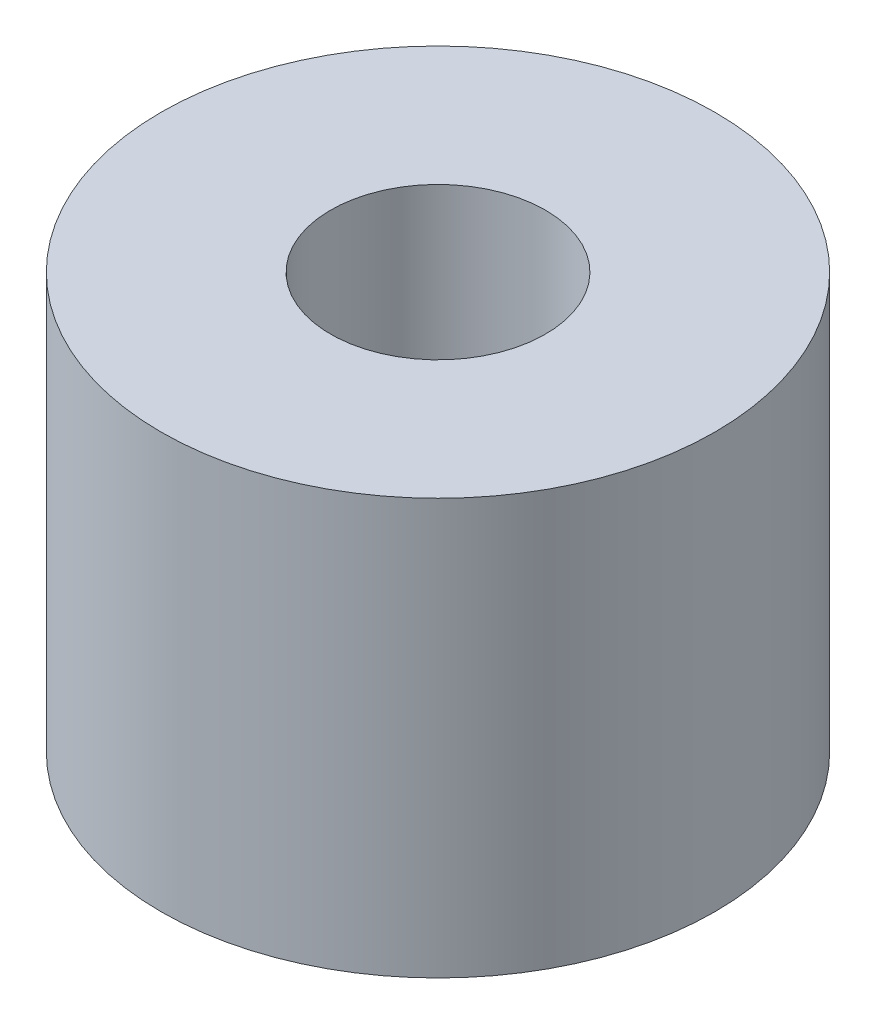
ISO-10303-21;
HEADER;
FILE_DESCRIPTION(('STEP AP214'),'2;1');
FILE_NAME('part.step','',(''),(''),'','','');
FILE_SCHEMA(('AUTOMOTIVE_DESIGN { 1 0 10303 214 1 1 1 1 }'));
ENDSEC;
DATA;
#1=APPLICATION_CONTEXT('core data for automotive mechanical design processes');
#2=APPLICATION_PROTOCOL_DEFINITION('international standard','automotive_design',2000,#1);
#3=PRODUCT_CONTEXT('',#1,'mechanical');
#4=PRODUCT('Part','Part','',(#3));
#5=PRODUCT_RELATED_PRODUCT_CATEGORY('part','',(#4));
#6=PRODUCT_DEFINITION_FORMATION('','',#4);
#7=PRODUCT_DEFINITION_CONTEXT('part definition',#1,'design');
#8=PRODUCT_DEFINITION('design','',#6,#7);
#9=PRODUCT_DEFINITION_SHAPE('','',#8);
#10=(LENGTH_UNIT() NAMED_UNIT(*) SI_UNIT(.MILLI.,.METRE.));
#11=(NAMED_UNIT(*) PLANE_ANGLE_UNIT() SI_UNIT($,.RADIAN.));
#12=(NAMED_UNIT(*) SI_UNIT($,.STERADIAN.) SOLID_ANGLE_UNIT());
#13=UNCERTAINTY_MEASURE_WITH_UNIT(LENGTH_MEASURE(1.E-05),#10,'distance_accuracy_value','');
#14=(GEOMETRIC_REPRESENTATION_CONTEXT(3) GLOBAL_UNCERTAINTY_ASSIGNED_CONTEXT((#13)) GLOBAL_UNIT_ASSIGNED_CONTEXT((#10,
#11,#12)) REPRESENTATION_CONTEXT('',''));
#15=CARTESIAN_POINT('',(0.,0.,0.));
#16=DIRECTION('',(0.,0.,1.));
#17=DIRECTION('',(1.,0.,0.));
#18=AXIS2_PLACEMENT_3D('',#15,#16,#17);
#19=CARTESIAN_POINT('',(0.,4.7625,0.));
#20=DIRECTION('',(0.,-1.,0.));
#21=DIRECTION('',(0.,0.,-1.));
#22=AXIS2_PLACEMENT_3D('',#19,#20,#21);
#23=CYLINDRICAL_SURFACE('',#22,2.4638);
#24=CARTESIAN_POINT('',(0.,-4.7625,0.));
#25=DIRECTION('',(0.,-1.,0.));
#26=DIRECTION('',(0.,0.,-1.));
#27=AXIS2_PLACEMENT_3D('',#24,#25,#26);
#28=CIRCLE('',#27,2.4638);
#29=CARTESIAN_POINT('',(0.,-4.7625,-2.4638));
#30=VERTEX_POINT('',#29);
#31=EDGE_CURVE('E28',#30,#30,#28,.T.);
#32=ORIENTED_EDGE('',*,*,#31,.T.);
#33=EDGE_LOOP('',(#32));
#34=FACE_BOUND('',#33,.T.);
#35=CARTESIAN_POINT('',(0.,4.7625,0.));
#36=DIRECTION('',(0.,-1.,0.));
#37=DIRECTION('',(0.,0.,-1.));
#38=AXIS2_PLACEMENT_3D('',#35,#36,#37);
#39=CIRCLE('',#38,2.4638);
#40=CARTESIAN_POINT('',(0.,4.7625,-2.4638));
#41=VERTEX_POINT('',#40);
#42=EDGE_CURVE('E19',#41,#41,#39,.T.);
#43=ORIENTED_EDGE('',*,*,#42,.F.);
#44=EDGE_LOOP('',(#43));
#45=FACE_BOUND('',#44,.T.);
#46=ADVANCED_FACE('F16',(#34,#45),#23,.F.);
#47=CARTESIAN_POINT('',(0.,4.7625,0.));
#48=DIRECTION('',(0.,1.,0.));
#49=DIRECTION('',(0.,0.,1.));
#50=AXIS2_PLACEMENT_3D('',#47,#48,#49);
#51=PLANE('',#50);
#52=ORIENTED_EDGE('',*,*,#42,.T.);
#53=EDGE_LOOP('',(#52));
#54=FACE_BOUND('',#53,.T.);
#55=CARTESIAN_POINT('',(0.,4.7625,0.));
#56=DIRECTION('',(0.,-1.,0.));
#57=DIRECTION('',(0.,0.,-1.));
#58=AXIS2_PLACEMENT_3D('',#55,#56,#57);
#59=CIRCLE('',#58,6.35);
#60=CARTESIAN_POINT('',(0.,4.7625,-6.35));
#61=VERTEX_POINT('',#60);
#62=EDGE_CURVE('E23',#61,#61,#59,.T.);
#63=ORIENTED_EDGE('',*,*,#62,.F.);
#64=EDGE_LOOP('',(#63));
#65=FACE_BOUND('',#64,.T.);
#66=ADVANCED_FACE('F36',(#54,#65),#51,.T.);
#67=CARTESIAN_POINT('',(0.,-4.7625,0.));
#68=DIRECTION('',(0.,1.,0.));
#69=DIRECTION('',(0.,0.,1.));
#70=AXIS2_PLACEMENT_3D('',#67,#68,#69);
#71=PLANE('',#70);
#72=ORIENTED_EDGE('',*,*,#31,.F.);
#73=EDGE_LOOP('',(#72));
#74=FACE_BOUND('',#73,.T.);
#75=CARTESIAN_POINT('',(0.,-4.7625,0.));
#76=DIRECTION('',(0.,-1.,0.));
#77=DIRECTION('',(0.,0.,-1.));
#78=AXIS2_PLACEMENT_3D('',#75,#76,#77);
#79=CIRCLE('',#78,6.35);
#80=CARTESIAN_POINT('',(0.,-4.7625,-6.35));
#81=VERTEX_POINT('',#80);
#82=EDGE_CURVE('E10',#81,#81,#79,.F.);
#83=ORIENTED_EDGE('',*,*,#82,.F.);
#84=EDGE_LOOP('',(#83));
#85=FACE_BOUND('',#84,.T.);
#86=ADVANCED_FACE('F43',(#74,#85),#71,.F.);
#87=CARTESIAN_POINT('',(0.,4.7625,0.));
#88=DIRECTION('',(0.,-1.,0.));
#89=DIRECTION('',(0.,0.,-1.));
#90=AXIS2_PLACEMENT_3D('',#87,#88,#89);
#91=CYLINDRICAL_SURFACE('',#90,6.35);
#92=ORIENTED_EDGE('',*,*,#82,.T.);
#93=EDGE_LOOP('',(#92));
#94=FACE_BOUND('',#93,.T.);
#95=ORIENTED_EDGE('',*,*,#62,.T.);
#96=EDGE_LOOP('',(#95));
#97=FACE_BOUND('',#96,.T.);
#98=ADVANCED_FACE('F44',(#94,#97),#91,.T.);
#99=CLOSED_SHELL('',(#46,#66,#86,#98));
#100=MANIFOLD_SOLID_BREP('B1',#99);
#101=ADVANCED_BREP_SHAPE_REPRESENTATION('',(#18,#100),#14);
#102=SHAPE_DEFINITION_REPRESENTATION(#9,#101);
ENDSEC;
END-ISO-10303-21;
